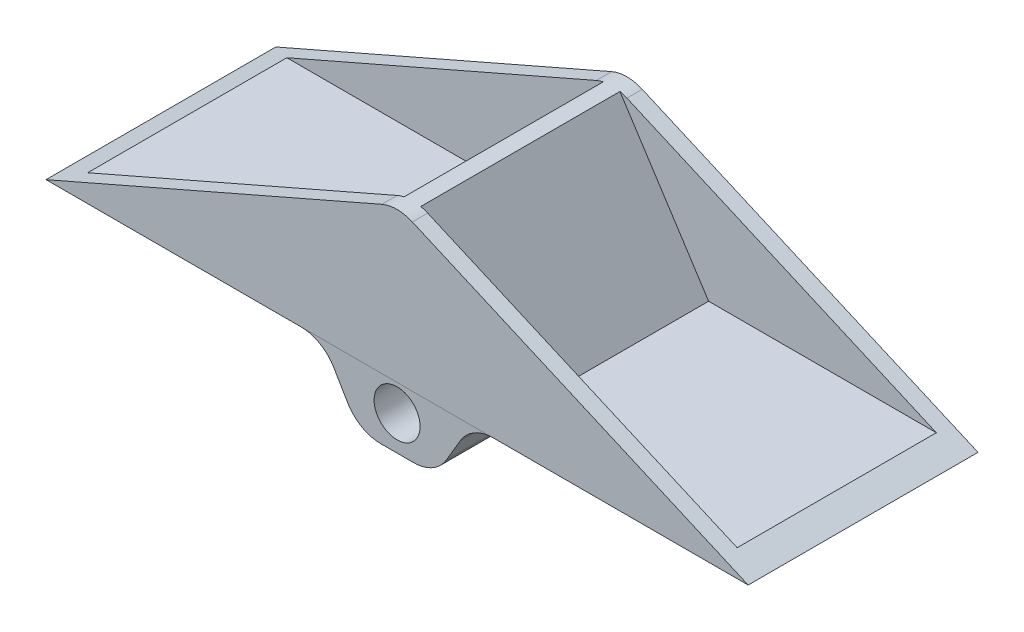
ISO-10303-21;
HEADER;
FILE_DESCRIPTION(('STEP AP214'),'2;1');
FILE_NAME('part.step','',(''),(''),'','','');
FILE_SCHEMA(('AUTOMOTIVE_DESIGN { 1 0 10303 214 1 1 1 1 }'));
ENDSEC;
DATA;
#1=APPLICATION_CONTEXT('core data for automotive mechanical design processes');
#2=APPLICATION_PROTOCOL_DEFINITION('international standard','automotive_design',2000,#1);
#3=PRODUCT_CONTEXT('',#1,'mechanical');
#4=PRODUCT('Part','Part','',(#3));
#5=PRODUCT_RELATED_PRODUCT_CATEGORY('part','',(#4));
#6=PRODUCT_DEFINITION_FORMATION('','',#4);
#7=PRODUCT_DEFINITION_CONTEXT('part definition',#1,'design');
#8=PRODUCT_DEFINITION('design','',#6,#7);
#9=PRODUCT_DEFINITION_SHAPE('','',#8);
#10=(LENGTH_UNIT() NAMED_UNIT(*) SI_UNIT(.MILLI.,.METRE.));
#11=(NAMED_UNIT(*) PLANE_ANGLE_UNIT() SI_UNIT($,.RADIAN.));
#12=(NAMED_UNIT(*) SI_UNIT($,.STERADIAN.) SOLID_ANGLE_UNIT());
#13=UNCERTAINTY_MEASURE_WITH_UNIT(LENGTH_MEASURE(1.E-05),#10,'distance_accuracy_value','');
#14=(GEOMETRIC_REPRESENTATION_CONTEXT(3) GLOBAL_UNCERTAINTY_ASSIGNED_CONTEXT((#13)) GLOBAL_UNIT_ASSIGNED_CONTEXT((#10,
#11,#12)) REPRESENTATION_CONTEXT('',''));
#15=CARTESIAN_POINT('',(0.,0.,0.));
#16=DIRECTION('',(0.,0.,1.));
#17=DIRECTION('',(1.,0.,0.));
#18=AXIS2_PLACEMENT_3D('',#15,#16,#17);
#19=CARTESIAN_POINT('',(-12.5662389811187,0.,30.));
#20=DIRECTION('',(0.000618349914558494,0.999999808821673,0.));
#21=DIRECTION('',(-0.999999808821673,0.000618349914558494,0.));
#22=AXIS2_PLACEMENT_3D('',#19,#20,#21);
#23=PLANE('',#22);
#24=DIRECTION('',(0.999999808821673,-0.000618349914558494,0.));
#25=VECTOR('',#24,1.);
#26=CARTESIAN_POINT('',(-4.80478462315431E-06,-0.00777033131477712,0.));
#27=LINE('',#26,#25);
#28=CARTESIAN_POINT('',(-12.5631472315459,-9.55891633208639E-07,0.));
#29=VERTEX_POINT('',#28);
#30=CARTESIAN_POINT('',(12.1753990297675,-0.0152989926749036,0.));
#31=VERTEX_POINT('',#30);
#32=EDGE_CURVE('E129',#29,#31,#27,.T.);
#33=ORIENTED_EDGE('',*,*,#32,.F.);
#34=DIRECTION('',(0.,0.,1.));
#35=VECTOR('',#34,1.);
#36=CARTESIAN_POINT('',(-12.5631472318414,-1.43383735873998E-06,30.));
#37=LINE('',#36,#35);
#38=CARTESIAN_POINT('',(-12.5631472315459,-9.55891633208639E-07,30.));
#39=VERTEX_POINT('',#38);
#40=EDGE_CURVE('E128',#39,#29,#37,.F.);
#41=ORIENTED_EDGE('',*,*,#40,.F.);
#42=DIRECTION('',(0.999999808821673,-0.000618349914558494,0.));
#43=VECTOR('',#42,1.);
#44=CARTESIAN_POINT('',(-4.80478462315431E-06,-0.00777033131477712,30.));
#45=LINE('',#44,#43);
#46=CARTESIAN_POINT('',(12.1753990297675,-0.0152989926749036,30.));
#47=VERTEX_POINT('',#46);
#48=EDGE_CURVE('E117',#39,#47,#45,.T.);
#49=ORIENTED_EDGE('',*,*,#48,.T.);
#50=DIRECTION('',(0.,0.,1.));
#51=VECTOR('',#50,1.);
#52=CARTESIAN_POINT('',(12.1753990297675,-0.0152989926749036,30.));
#53=LINE('',#52,#51);
#54=EDGE_CURVE('E127',#47,#31,#53,.F.);
#55=ORIENTED_EDGE('',*,*,#54,.T.);
#56=EDGE_LOOP('',(#33,#41,#49,#55));
#57=FACE_BOUND('',#56,.T.);
#58=ADVANCED_FACE('F45',(#57),#23,.T.);
#59=CARTESIAN_POINT('',(-2.14054862888333,-3.,30.));
#60=DIRECTION('',(0.,0.,1.));
#61=DIRECTION('',(1.,0.,0.));
#62=AXIS2_PLACEMENT_3D('',#59,#60,#61);
#63=CYLINDRICAL_SURFACE('',#62,5.);
#64=CARTESIAN_POINT('',(-2.14054862888333,-3.,30.));
#65=DIRECTION('',(0.,0.,-1.));
#66=DIRECTION('',(-1.,0.,0.));
#67=AXIS2_PLACEMENT_3D('',#64,#65,#66);
#68=CIRCLE('',#67,5.);
#69=CARTESIAN_POINT('',(-6.45000657940908,-5.5354629109199,30.));
#70=VERTEX_POINT('',#69);
#71=CARTESIAN_POINT('',(-2.14054862888333,-8.,30.));
#72=VERTEX_POINT('',#71);
#73=EDGE_CURVE('E143',#70,#72,#68,.F.);
#74=ORIENTED_EDGE('',*,*,#73,.F.);
#75=DIRECTION('',(0.,0.,-1.));
#76=VECTOR('',#75,1.);
#77=CARTESIAN_POINT('',(-6.45000657940908,-5.5354629109199,30.));
#78=LINE('',#77,#76);
#79=CARTESIAN_POINT('',(-6.45000657940908,-5.5354629109199,0.));
#80=VERTEX_POINT('',#79);
#81=EDGE_CURVE('E149',#80,#70,#78,.F.);
#82=ORIENTED_EDGE('',*,*,#81,.F.);
#83=CARTESIAN_POINT('',(-2.14054862888333,-3.,0.));
#84=DIRECTION('',(0.,0.,-1.));
#85=DIRECTION('',(-1.,0.,0.));
#86=AXIS2_PLACEMENT_3D('',#83,#84,#85);
#87=CIRCLE('',#86,5.);
#88=CARTESIAN_POINT('',(-2.14054862888333,-8.,0.));
#89=VERTEX_POINT('',#88);
#90=EDGE_CURVE('E153',#89,#80,#87,.T.);
#91=ORIENTED_EDGE('',*,*,#90,.F.);
#92=DIRECTION('',(0.,0.,-1.));
#93=VECTOR('',#92,1.);
#94=CARTESIAN_POINT('',(-2.14054862888333,-8.,0.));
#95=LINE('',#94,#93);
#96=EDGE_CURVE('E123',#72,#89,#95,.T.);
#97=ORIENTED_EDGE('',*,*,#96,.F.);
#98=EDGE_LOOP('',(#74,#82,#91,#97));
#99=FACE_BOUND('',#98,.T.);
#100=ADVANCED_FACE('F195',(#99),#63,.T.);
#101=CARTESIAN_POINT('',(0.,-8.,30.));
#102=DIRECTION('',(0.,1.,0.));
#103=DIRECTION('',(0.,0.,1.));
#104=AXIS2_PLACEMENT_3D('',#101,#102,#103);
#105=PLANE('',#104);
#106=DIRECTION('',(1.,0.,0.));
#107=VECTOR('',#106,1.);
#108=CARTESIAN_POINT('',(0.,-8.,30.));
#109=LINE('',#108,#107);
#110=CARTESIAN_POINT('',(2.14054862888333,-8.,30.));
#111=VERTEX_POINT('',#110);
#112=EDGE_CURVE('E170',#72,#111,#109,.T.);
#113=ORIENTED_EDGE('',*,*,#112,.F.);
#114=ORIENTED_EDGE('',*,*,#96,.T.);
#115=DIRECTION('',(1.,0.,0.));
#116=VECTOR('',#115,1.);
#117=CARTESIAN_POINT('',(0.,-8.,0.));
#118=LINE('',#117,#116);
#119=CARTESIAN_POINT('',(2.14054862888333,-8.,0.));
#120=VERTEX_POINT('',#119);
#121=EDGE_CURVE('E169',#89,#120,#118,.T.);
#122=ORIENTED_EDGE('',*,*,#121,.T.);
#123=DIRECTION('',(0.,0.,-1.));
#124=VECTOR('',#123,1.);
#125=CARTESIAN_POINT('',(2.14054862888333,-8.,30.));
#126=LINE('',#125,#124);
#127=EDGE_CURVE('E160',#120,#111,#126,.F.);
#128=ORIENTED_EDGE('',*,*,#127,.T.);
#129=EDGE_LOOP('',(#113,#114,#122,#128));
#130=FACE_BOUND('',#129,.T.);
#131=ADVANCED_FACE('F187',(#130),#105,.F.);
#132=CARTESIAN_POINT('',(2.14054862888333,-3.,30.));
#133=DIRECTION('',(0.,0.,-1.));
#134=DIRECTION('',(-1.,0.,0.));
#135=AXIS2_PLACEMENT_3D('',#132,#133,#134);
#136=CYLINDRICAL_SURFACE('',#135,5.);
#137=CARTESIAN_POINT('',(2.14054862888333,-3.,30.));
#138=DIRECTION('',(0.,0.,-1.));
#139=DIRECTION('',(-1.,0.,0.));
#140=AXIS2_PLACEMENT_3D('',#137,#138,#139);
#141=CIRCLE('',#140,5.);
#142=CARTESIAN_POINT('',(6.45000657940908,-5.5354629109199,30.));
#143=VERTEX_POINT('',#142);
#144=EDGE_CURVE('E70',#111,#143,#141,.F.);
#145=ORIENTED_EDGE('',*,*,#144,.F.);
#146=ORIENTED_EDGE('',*,*,#127,.F.);
#147=CARTESIAN_POINT('',(2.14054862888333,-3.,0.));
#148=DIRECTION('',(0.,0.,-1.));
#149=DIRECTION('',(-1.,0.,0.));
#150=AXIS2_PLACEMENT_3D('',#147,#148,#149);
#151=CIRCLE('',#150,5.);
#152=CARTESIAN_POINT('',(6.45000657940908,-5.5354629109199,0.));
#153=VERTEX_POINT('',#152);
#154=EDGE_CURVE('E62',#153,#120,#151,.T.);
#155=ORIENTED_EDGE('',*,*,#154,.F.);
#156=DIRECTION('',(0.,0.,-1.));
#157=VECTOR('',#156,1.);
#158=CARTESIAN_POINT('',(6.45000657940908,-5.5354629109199,30.));
#159=LINE('',#158,#157);
#160=EDGE_CURVE('E164',#143,#153,#159,.T.);
#161=ORIENTED_EDGE('',*,*,#160,.F.);
#162=EDGE_LOOP('',(#145,#146,#155,#161));
#163=FACE_BOUND('',#162,.T.);
#164=ADVANCED_FACE('F184',(#163),#136,.T.);
#165=CARTESIAN_POINT('',(0.,-3.5,30.));
#166=DIRECTION('',(0.,0.,-1.));
#167=DIRECTION('',(-1.,0.,0.));
#168=AXIS2_PLACEMENT_3D('',#165,#166,#167);
#169=CYLINDRICAL_SURFACE('',#168,3.);
#170=CARTESIAN_POINT('',(0.,-3.5,30.));
#171=DIRECTION('',(0.,0.,1.));
#172=DIRECTION('',(1.,0.,0.));
#173=AXIS2_PLACEMENT_3D('',#170,#171,#172);
#174=CIRCLE('',#173,3.);
#175=CARTESIAN_POINT('',(3.,-3.5,30.));
#176=VERTEX_POINT('',#175);
#177=EDGE_CURVE('E54',#176,#176,#174,.T.);
#178=ORIENTED_EDGE('',*,*,#177,.T.);
#179=EDGE_LOOP('',(#178));
#180=FACE_BOUND('',#179,.T.);
#181=CARTESIAN_POINT('',(0.,-3.5,0.));
#182=DIRECTION('',(0.,0.,1.));
#183=DIRECTION('',(1.,0.,0.));
#184=AXIS2_PLACEMENT_3D('',#181,#182,#183);
#185=CIRCLE('',#184,3.);
#186=CARTESIAN_POINT('',(3.,-3.5,0.));
#187=VERTEX_POINT('',#186);
#188=EDGE_CURVE('E12',#187,#187,#185,.T.);
#189=ORIENTED_EDGE('',*,*,#188,.F.);
#190=EDGE_LOOP('',(#189));
#191=FACE_BOUND('',#190,.T.);
#192=ADVANCED_FACE('F217',(#180,#191),#169,.F.);
#193=CARTESIAN_POINT('',(5.,-8.,30.));
#194=DIRECTION('',(-0.86189159010515,0.507092582183979,0.));
#195=DIRECTION('',(-0.507092582183979,-0.86189159010515,0.));
#196=AXIS2_PLACEMENT_3D('',#193,#194,#195);
#197=PLANE('',#196);
#198=DIRECTION('',(0.507092582183979,0.86189159010515,0.));
#199=VECTOR('',#198,1.);
#200=CARTESIAN_POINT('',(5.,-8.,0.));
#201=LINE('',#200,#199);
#202=CARTESIAN_POINT('',(8.25678103059292,-2.4645370890801,0.));
#203=VERTEX_POINT('',#202);
#204=EDGE_CURVE('E166',#153,#203,#201,.T.);
#205=ORIENTED_EDGE('',*,*,#204,.T.);
#206=DIRECTION('',(0.,0.,-1.));
#207=VECTOR('',#206,1.);
#208=CARTESIAN_POINT('',(8.25678103059292,-2.4645370890801,30.));
#209=LINE('',#208,#207);
#210=CARTESIAN_POINT('',(8.25678103059292,-2.4645370890801,30.));
#211=VERTEX_POINT('',#210);
#212=EDGE_CURVE('E157',#203,#211,#209,.F.);
#213=ORIENTED_EDGE('',*,*,#212,.T.);
#214=DIRECTION('',(0.507092582183979,0.86189159010515,0.));
#215=VECTOR('',#214,1.);
#216=CARTESIAN_POINT('',(5.,-8.,30.));
#217=LINE('',#216,#215);
#218=EDGE_CURVE('E119',#143,#211,#217,.T.);
#219=ORIENTED_EDGE('',*,*,#218,.F.);
#220=ORIENTED_EDGE('',*,*,#160,.T.);
#221=EDGE_LOOP('',(#205,#213,#219,#220));
#222=FACE_BOUND('',#221,.T.);
#223=ADVANCED_FACE('F183',(#222),#197,.F.);
#224=CARTESIAN_POINT('',(-5.,-8.,30.));
#225=DIRECTION('',(-0.86189159010515,-0.507092582183979,0.));
#226=DIRECTION('',(0.507092582183979,-0.86189159010515,0.));
#227=AXIS2_PLACEMENT_3D('',#224,#225,#226);
#228=PLANE('',#227);
#229=DIRECTION('',(-0.507092582183979,0.86189159010515,0.));
#230=VECTOR('',#229,1.);
#231=CARTESIAN_POINT('',(-5.,-8.,30.));
#232=LINE('',#231,#230);
#233=CARTESIAN_POINT('',(-8.25678103059292,-2.4645370890801,30.));
#234=VERTEX_POINT('',#233);
#235=EDGE_CURVE('E172',#70,#234,#232,.T.);
#236=ORIENTED_EDGE('',*,*,#235,.T.);
#237=DIRECTION('',(0.,0.,-1.));
#238=VECTOR('',#237,1.);
#239=CARTESIAN_POINT('',(-8.25678103059292,-2.4645370890801,0.));
#240=LINE('',#239,#238);
#241=CARTESIAN_POINT('',(-8.25678103059292,-2.4645370890801,0.));
#242=VERTEX_POINT('',#241);
#243=EDGE_CURVE('E139',#234,#242,#240,.T.);
#244=ORIENTED_EDGE('',*,*,#243,.T.);
#245=DIRECTION('',(-0.507092582183979,0.86189159010515,0.));
#246=VECTOR('',#245,1.);
#247=CARTESIAN_POINT('',(-5.,-8.,0.));
#248=LINE('',#247,#246);
#249=EDGE_CURVE('E175',#80,#242,#248,.T.);
#250=ORIENTED_EDGE('',*,*,#249,.F.);
#251=ORIENTED_EDGE('',*,*,#81,.T.);
#252=EDGE_LOOP('',(#236,#244,#250,#251));
#253=FACE_BOUND('',#252,.T.);
#254=ADVANCED_FACE('F192',(#253),#228,.T.);
#255=CARTESIAN_POINT('',(0.,0.,0.));
#256=DIRECTION('',(0.,0.,-1.));
#257=DIRECTION('',(-1.,0.,0.));
#258=AXIS2_PLACEMENT_3D('',#255,#256,#257);
#259=PLANE('',#258);
#260=ORIENTED_EDGE('',*,*,#188,.T.);
#261=EDGE_LOOP('',(#260));
#262=FACE_BOUND('',#261,.T.);
#263=CARTESIAN_POINT('',(-12.5662389811187,-5.,0.));
#264=DIRECTION('',(0.,0.,-1.));
#265=DIRECTION('',(-1.,0.,0.));
#266=AXIS2_PLACEMENT_3D('',#263,#264,#265);
#267=CIRCLE('',#266,5.);
#268=EDGE_CURVE('E137',#242,#29,#267,.F.);
#269=ORIENTED_EDGE('',*,*,#268,.T.);
#270=ORIENTED_EDGE('',*,*,#32,.T.);
#271=CARTESIAN_POINT('',(12.5662389811187,-5.,0.));
#272=DIRECTION('',(0.,0.,-1.));
#273=DIRECTION('',(-1.,0.,0.));
#274=AXIS2_PLACEMENT_3D('',#271,#272,#273);
#275=CIRCLE('',#274,5.);
#276=EDGE_CURVE('E49',#31,#203,#275,.F.);
#277=ORIENTED_EDGE('',*,*,#276,.T.);
#278=ORIENTED_EDGE('',*,*,#204,.F.);
#279=ORIENTED_EDGE('',*,*,#154,.T.);
#280=ORIENTED_EDGE('',*,*,#121,.F.);
#281=ORIENTED_EDGE('',*,*,#90,.T.);
#282=ORIENTED_EDGE('',*,*,#249,.T.);
#283=EDGE_LOOP('',(#269,#270,#277,#278,#279,#280,#281,#282));
#284=FACE_BOUND('',#283,.T.);
#285=ADVANCED_FACE('F180',(#262,#284),#259,.T.);
#286=CARTESIAN_POINT('',(0.,0.,30.));
#287=DIRECTION('',(0.,0.,-1.));
#288=DIRECTION('',(-1.,0.,0.));
#289=AXIS2_PLACEMENT_3D('',#286,#287,#288);
#290=PLANE('',#289);
#291=ORIENTED_EDGE('',*,*,#177,.F.);
#292=EDGE_LOOP('',(#291));
#293=FACE_BOUND('',#292,.T.);
#294=ORIENTED_EDGE('',*,*,#48,.F.);
#295=CARTESIAN_POINT('',(-12.5662389811187,-5.,30.));
#296=DIRECTION('',(0.,0.,-1.));
#297=DIRECTION('',(-1.,0.,0.));
#298=AXIS2_PLACEMENT_3D('',#295,#296,#297);
#299=CIRCLE('',#298,5.);
#300=EDGE_CURVE('E135',#39,#234,#299,.T.);
#301=ORIENTED_EDGE('',*,*,#300,.T.);
#302=ORIENTED_EDGE('',*,*,#235,.F.);
#303=ORIENTED_EDGE('',*,*,#73,.T.);
#304=ORIENTED_EDGE('',*,*,#112,.T.);
#305=ORIENTED_EDGE('',*,*,#144,.T.);
#306=ORIENTED_EDGE('',*,*,#218,.T.);
#307=CARTESIAN_POINT('',(12.5662389811187,-5.,30.));
#308=DIRECTION('',(0.,0.,-1.));
#309=DIRECTION('',(-1.,0.,0.));
#310=AXIS2_PLACEMENT_3D('',#307,#308,#309);
#311=CIRCLE('',#310,5.);
#312=EDGE_CURVE('E114',#211,#47,#311,.T.);
#313=ORIENTED_EDGE('',*,*,#312,.T.);
#314=EDGE_LOOP('',(#294,#301,#302,#303,#304,#305,#306,#313));
#315=FACE_BOUND('',#314,.T.);
#316=ADVANCED_FACE('F116',(#293,#315),#290,.F.);
#317=CARTESIAN_POINT('',(-12.5662389811187,-5.,30.));
#318=DIRECTION('',(0.,0.,1.));
#319=DIRECTION('',(1.,0.,0.));
#320=AXIS2_PLACEMENT_3D('',#317,#318,#319);
#321=CYLINDRICAL_SURFACE('',#320,5.);
#322=ORIENTED_EDGE('',*,*,#300,.F.);
#323=ORIENTED_EDGE('',*,*,#40,.T.);
#324=ORIENTED_EDGE('',*,*,#268,.F.);
#325=ORIENTED_EDGE('',*,*,#243,.F.);
#326=EDGE_LOOP('',(#322,#323,#324,#325));
#327=FACE_BOUND('',#326,.T.);
#328=ADVANCED_FACE('F197',(#327),#321,.F.);
#329=CARTESIAN_POINT('',(12.5662389811187,-5.,30.));
#330=DIRECTION('',(0.,0.,1.));
#331=DIRECTION('',(1.,0.,0.));
#332=AXIS2_PLACEMENT_3D('',#329,#330,#331);
#333=CYLINDRICAL_SURFACE('',#332,5.);
#334=ORIENTED_EDGE('',*,*,#54,.F.);
#335=ORIENTED_EDGE('',*,*,#312,.F.);
#336=ORIENTED_EDGE('',*,*,#212,.F.);
#337=ORIENTED_EDGE('',*,*,#276,.F.);
#338=EDGE_LOOP('',(#334,#335,#336,#337));
#339=FACE_BOUND('',#338,.T.);
#340=ADVANCED_FACE('F47',(#339),#333,.F.);
#341=CLOSED_SHELL('',(#58,#100,#131,#164,#192,#223,#254,#285,#316,#328,#340));
#342=MANIFOLD_SOLID_BREP('B2',#341);
#343=CARTESIAN_POINT('',(-12.5662389811187,0.,30.));
#344=DIRECTION('',(0.000618349914558494,0.999999808821673,0.));
#345=DIRECTION('',(-0.999999808821673,0.000618349914558494,0.));
#346=AXIS2_PLACEMENT_3D('',#343,#344,#345);
#347=PLANE('',#346);
#348=DIRECTION('',(0.999999808821673,-0.000618349914558494,0.));
#349=VECTOR('',#348,1.);
#350=CARTESIAN_POINT('',(-4.80478462315431E-06,-0.00777033131477712,0.));
#351=LINE('',#350,#349);
#352=CARTESIAN_POINT('',(-12.5631472315459,-9.55891633208639E-07,0.));
#353=VERTEX_POINT('',#352);
#354=CARTESIAN_POINT('',(12.1753990297675,-0.0152989926749036,0.));
#355=VERTEX_POINT('',#354);
#356=EDGE_CURVE('E314',#353,#355,#351,.T.);
#357=ORIENTED_EDGE('',*,*,#356,.T.);
#358=DIRECTION('',(0.,0.,1.));
#359=VECTOR('',#358,1.);
#360=CARTESIAN_POINT('',(12.1753990297675,-0.0152989926749036,30.));
#361=LINE('',#360,#359);
#362=CARTESIAN_POINT('',(12.1753990297675,-0.0152989926749036,30.));
#363=VERTEX_POINT('',#362);
#364=EDGE_CURVE('E542',#363,#355,#361,.F.);
#365=ORIENTED_EDGE('',*,*,#364,.F.);
#366=DIRECTION('',(0.999999808821673,-0.000618349914558494,0.));
#367=VECTOR('',#366,1.);
#368=CARTESIAN_POINT('',(-4.80478462315431E-06,-0.00777033131477712,30.));
#369=LINE('',#368,#367);
#370=CARTESIAN_POINT('',(-12.5631472315459,-9.55891633208639E-07,30.));
#371=VERTEX_POINT('',#370);
#372=EDGE_CURVE('E545',#371,#363,#369,.T.);
#373=ORIENTED_EDGE('',*,*,#372,.F.);
#374=DIRECTION('',(0.,0.,1.));
#375=VECTOR('',#374,1.);
#376=CARTESIAN_POINT('',(-12.5631472318414,-1.43383735873998E-06,30.));
#377=LINE('',#376,#375);
#378=EDGE_CURVE('E43',#371,#353,#377,.F.);
#379=ORIENTED_EDGE('',*,*,#378,.T.);
#380=EDGE_LOOP('',(#357,#365,#373,#379));
#381=FACE_BOUND('',#380,.T.);
#382=ADVANCED_FACE('F311',(#381),#347,.F.);
#383=CARTESIAN_POINT('',(-12.5662389811187,-5.,30.));
#384=DIRECTION('',(0.,0.,1.));
#385=DIRECTION('',(1.,0.,0.));
#386=AXIS2_PLACEMENT_3D('',#383,#384,#385);
#387=CYLINDRICAL_SURFACE('',#386,5.);
#388=ORIENTED_EDGE('',*,*,#378,.F.);
#389=CARTESIAN_POINT('',(-12.5662389811187,-5.,30.));
#390=DIRECTION('',(0.,0.,-1.));
#391=DIRECTION('',(-1.,0.,0.));
#392=AXIS2_PLACEMENT_3D('',#389,#390,#391);
#393=CIRCLE('',#392,5.);
#394=CARTESIAN_POINT('',(-12.5662389811187,0.,30.));
#395=VERTEX_POINT('',#394);
#396=EDGE_CURVE('E515',#395,#371,#393,.T.);
#397=ORIENTED_EDGE('',*,*,#396,.F.);
#398=DIRECTION('',(0.,0.,-1.));
#399=VECTOR('',#398,1.);
#400=CARTESIAN_POINT('',(-12.5662389811187,0.,30.));
#401=LINE('',#400,#399);
#402=CARTESIAN_POINT('',(-12.5662389811187,0.,0.));
#403=VERTEX_POINT('',#402);
#404=EDGE_CURVE('E510',#403,#395,#401,.F.);
#405=ORIENTED_EDGE('',*,*,#404,.F.);
#406=CARTESIAN_POINT('',(-12.5662389811187,-5.,0.));
#407=DIRECTION('',(0.,0.,-1.));
#408=DIRECTION('',(-1.,0.,0.));
#409=AXIS2_PLACEMENT_3D('',#406,#407,#408);
#410=CIRCLE('',#409,5.);
#411=EDGE_CURVE('E513',#353,#403,#410,.F.);
#412=ORIENTED_EDGE('',*,*,#411,.F.);
#413=EDGE_LOOP('',(#388,#397,#405,#412));
#414=FACE_BOUND('',#413,.T.);
#415=ADVANCED_FACE('F586',(#414),#387,.F.);
#416=CARTESIAN_POINT('',(-45.8257569495584,0.,30.));
#417=DIRECTION('',(-0.4,0.916515138991168,0.));
#418=DIRECTION('',(-0.916515138991168,-0.4,0.));
#419=AXIS2_PLACEMENT_3D('',#416,#417,#418);
#420=PLANE('',#419);
#421=DIRECTION('',(0.916515138991168,0.4,0.));
#422=VECTOR('',#421,1.);
#423=CARTESIAN_POINT('',(-45.8257569495584,0.,30.));
#424=LINE('',#423,#422);
#425=CARTESIAN_POINT('',(-45.8257569495584,0.,30.));
#426=VERTEX_POINT('',#425);
#427=CARTESIAN_POINT('',(-2.00000000000002,19.127128439056,30.));
#428=VERTEX_POINT('',#427);
#429=EDGE_CURVE('E458',#426,#428,#424,.T.);
#430=ORIENTED_EDGE('',*,*,#429,.T.);
#431=DIRECTION('',(0.,0.,-1.));
#432=VECTOR('',#431,1.);
#433=CARTESIAN_POINT('',(-2.00000000000001,19.127128439056,0.));
#434=LINE('',#433,#432);
#435=CARTESIAN_POINT('',(-2.,19.127128439056,28.));
#436=VERTEX_POINT('',#435);
#437=EDGE_CURVE('E521',#428,#436,#434,.T.);
#438=ORIENTED_EDGE('',*,*,#437,.T.);
#439=DIRECTION('',(0.916515138991168,0.4,0.));
#440=VECTOR('',#439,1.);
#441=CARTESIAN_POINT('',(-42.3888251783415,1.5,28.));
#442=LINE('',#441,#440);
#443=CARTESIAN_POINT('',(-42.3888251783415,1.5,28.));
#444=VERTEX_POINT('',#443);
#445=EDGE_CURVE('E432',#444,#436,#442,.T.);
#446=ORIENTED_EDGE('',*,*,#445,.F.);
#447=DIRECTION('',(0.,0.,-1.));
#448=VECTOR('',#447,1.);
#449=CARTESIAN_POINT('',(-42.3888251783415,1.5,28.));
#450=LINE('',#449,#448);
#451=CARTESIAN_POINT('',(-42.3888251783415,1.5,2.));
#452=VERTEX_POINT('',#451);
#453=EDGE_CURVE('E442',#444,#452,#450,.T.);
#454=ORIENTED_EDGE('',*,*,#453,.T.);
#455=DIRECTION('',(0.916515138991168,0.4,0.));
#456=VECTOR('',#455,1.);
#457=CARTESIAN_POINT('',(-42.3888251783415,1.5,2.));
#458=LINE('',#457,#456);
#459=CARTESIAN_POINT('',(-2.,19.127128439056,2.));
#460=VERTEX_POINT('',#459);
#461=EDGE_CURVE('E446',#452,#460,#458,.T.);
#462=ORIENTED_EDGE('',*,*,#461,.T.);
#463=DIRECTION('',(0.,0.,-1.));
#464=VECTOR('',#463,1.);
#465=CARTESIAN_POINT('',(-2.00000000000001,19.127128439056,0.));
#466=LINE('',#465,#464);
#467=CARTESIAN_POINT('',(-2.00000000000002,19.127128439056,0.));
#468=VERTEX_POINT('',#467);
#469=EDGE_CURVE('E519',#460,#468,#466,.T.);
#470=ORIENTED_EDGE('',*,*,#469,.T.);
#471=DIRECTION('',(0.916515138991168,0.4,0.));
#472=VECTOR('',#471,1.);
#473=CARTESIAN_POINT('',(-45.8257569495584,0.,0.));
#474=LINE('',#473,#472);
#475=CARTESIAN_POINT('',(-45.8257569495584,0.,0.));
#476=VERTEX_POINT('',#475);
#477=EDGE_CURVE('E459',#476,#468,#474,.T.);
#478=ORIENTED_EDGE('',*,*,#477,.F.);
#479=DIRECTION('',(0.,0.,-1.));
#480=VECTOR('',#479,1.);
#481=CARTESIAN_POINT('',(-45.8257569495584,0.,30.));
#482=LINE('',#481,#480);
#483=EDGE_CURVE('E462',#426,#476,#482,.T.);
#484=ORIENTED_EDGE('',*,*,#483,.F.);
#485=EDGE_LOOP('',(#430,#438,#446,#454,#462,#470,#478,#484));
#486=FACE_BOUND('',#485,.T.);
#487=ADVANCED_FACE('F580',(#486),#420,.T.);
#488=CARTESIAN_POINT('',(45.8257569495584,0.,30.));
#489=DIRECTION('',(-0.4,-0.916515138991168,0.));
#490=DIRECTION('',(0.916515138991168,-0.4,0.));
#491=AXIS2_PLACEMENT_3D('',#488,#489,#490);
#492=PLANE('',#491);
#493=DIRECTION('',(-0.916515138991168,0.4,0.));
#494=VECTOR('',#493,1.);
#495=CARTESIAN_POINT('',(45.8257569495584,0.,0.));
#496=LINE('',#495,#494);
#497=CARTESIAN_POINT('',(45.8257569495584,0.,0.));
#498=VERTEX_POINT('',#497);
#499=CARTESIAN_POINT('',(2.,19.127128439056,0.));
#500=VERTEX_POINT('',#499);
#501=EDGE_CURVE('E493',#498,#500,#496,.T.);
#502=ORIENTED_EDGE('',*,*,#501,.T.);
#503=DIRECTION('',(0.,0.,-1.));
#504=VECTOR('',#503,1.);
#505=CARTESIAN_POINT('',(2.,19.127128439056,30.));
#506=LINE('',#505,#504);
#507=CARTESIAN_POINT('',(1.99999999999999,19.127128439056,2.));
#508=VERTEX_POINT('',#507);
#509=EDGE_CURVE('E533',#500,#508,#506,.F.);
#510=ORIENTED_EDGE('',*,*,#509,.T.);
#511=DIRECTION('',(-0.916515138991168,0.4,0.));
#512=VECTOR('',#511,1.);
#513=CARTESIAN_POINT('',(42.3888251783415,1.5,2.));
#514=LINE('',#513,#512);
#515=CARTESIAN_POINT('',(42.3888251783415,1.5,2.));
#516=VERTEX_POINT('',#515);
#517=EDGE_CURVE('E480',#516,#508,#514,.T.);
#518=ORIENTED_EDGE('',*,*,#517,.F.);
#519=DIRECTION('',(0.,0.,-1.));
#520=VECTOR('',#519,1.);
#521=CARTESIAN_POINT('',(42.3888251783415,1.5,28.));
#522=LINE('',#521,#520);
#523=CARTESIAN_POINT('',(42.3888251783415,1.5,28.));
#524=VERTEX_POINT('',#523);
#525=EDGE_CURVE('E486',#524,#516,#522,.T.);
#526=ORIENTED_EDGE('',*,*,#525,.F.);
#527=DIRECTION('',(-0.916515138991168,0.4,0.));
#528=VECTOR('',#527,1.);
#529=CARTESIAN_POINT('',(42.3888251783415,1.5,28.));
#530=LINE('',#529,#528);
#531=CARTESIAN_POINT('',(1.99999999999999,19.127128439056,28.));
#532=VERTEX_POINT('',#531);
#533=EDGE_CURVE('E472',#524,#532,#530,.T.);
#534=ORIENTED_EDGE('',*,*,#533,.T.);
#535=DIRECTION('',(0.,0.,-1.));
#536=VECTOR('',#535,1.);
#537=CARTESIAN_POINT('',(2.,19.127128439056,30.));
#538=LINE('',#537,#536);
#539=CARTESIAN_POINT('',(2.,19.127128439056,30.));
#540=VERTEX_POINT('',#539);
#541=EDGE_CURVE('E531',#532,#540,#538,.F.);
#542=ORIENTED_EDGE('',*,*,#541,.T.);
#543=DIRECTION('',(-0.916515138991168,0.4,0.));
#544=VECTOR('',#543,1.);
#545=CARTESIAN_POINT('',(45.8257569495584,0.,30.));
#546=LINE('',#545,#544);
#547=CARTESIAN_POINT('',(45.8257569495584,0.,30.));
#548=VERTEX_POINT('',#547);
#549=EDGE_CURVE('E492',#548,#540,#546,.T.);
#550=ORIENTED_EDGE('',*,*,#549,.F.);
#551=DIRECTION('',(0.,0.,-1.));
#552=VECTOR('',#551,1.);
#553=CARTESIAN_POINT('',(45.8257569495584,0.,30.));
#554=LINE('',#553,#552);
#555=EDGE_CURVE('E496',#548,#498,#554,.T.);
#556=ORIENTED_EDGE('',*,*,#555,.T.);
#557=EDGE_LOOP('',(#502,#510,#518,#526,#534,#542,#550,#556));
#558=FACE_BOUND('',#557,.T.);
#559=ADVANCED_FACE('F567',(#558),#492,.F.);
#560=CARTESIAN_POINT('',(9.70678761000199,0.,30.));
#561=DIRECTION('',(0.,1.,0.));
#562=DIRECTION('',(0.,0.,1.));
#563=AXIS2_PLACEMENT_3D('',#560,#561,#562);
#564=PLANE('',#563);
#565=DIRECTION('',(1.,0.,0.));
#566=VECTOR('',#565,1.);
#567=CARTESIAN_POINT('',(9.70678761000199,0.,30.));
#568=LINE('',#567,#566);
#569=CARTESIAN_POINT('',(12.5662389811187,0.,30.));
#570=VERTEX_POINT('',#569);
#571=EDGE_CURVE('E490',#570,#548,#568,.T.);
#572=ORIENTED_EDGE('',*,*,#571,.F.);
#573=DIRECTION('',(0.,0.,-1.));
#574=VECTOR('',#573,1.);
#575=CARTESIAN_POINT('',(12.5662389811187,0.,0.));
#576=LINE('',#575,#574);
#577=CARTESIAN_POINT('',(12.5662389811187,0.,0.));
#578=VERTEX_POINT('',#577);
#579=EDGE_CURVE('E502',#570,#578,#576,.T.);
#580=ORIENTED_EDGE('',*,*,#579,.T.);
#581=DIRECTION('',(1.,0.,0.));
#582=VECTOR('',#581,1.);
#583=CARTESIAN_POINT('',(9.70678761000199,0.,0.));
#584=LINE('',#583,#582);
#585=EDGE_CURVE('E489',#578,#498,#584,.T.);
#586=ORIENTED_EDGE('',*,*,#585,.T.);
#587=ORIENTED_EDGE('',*,*,#555,.F.);
#588=EDGE_LOOP('',(#572,#580,#586,#587));
#589=FACE_BOUND('',#588,.T.);
#590=ADVANCED_FACE('F561',(#589),#564,.F.);
#591=CARTESIAN_POINT('',(0.,0.,30.));
#592=DIRECTION('',(0.,0.,-1.));
#593=DIRECTION('',(-1.,0.,0.));
#594=AXIS2_PLACEMENT_3D('',#591,#592,#593);
#595=PLANE('',#594);
#596=ORIENTED_EDGE('',*,*,#396,.T.);
#597=ORIENTED_EDGE('',*,*,#372,.T.);
#598=CARTESIAN_POINT('',(12.5662389811187,-5.,30.));
#599=DIRECTION('',(0.,0.,-1.));
#600=DIRECTION('',(-1.,0.,0.));
#601=AXIS2_PLACEMENT_3D('',#598,#599,#600);
#602=CIRCLE('',#601,5.);
#603=EDGE_CURVE('E508',#363,#570,#602,.T.);
#604=ORIENTED_EDGE('',*,*,#603,.T.);
#605=ORIENTED_EDGE('',*,*,#571,.T.);
#606=ORIENTED_EDGE('',*,*,#549,.T.);
#607=CARTESIAN_POINT('',(0.,14.5445527441002,30.));
#608=DIRECTION('',(0.,0.,-1.));
#609=DIRECTION('',(-1.,0.,0.));
#610=AXIS2_PLACEMENT_3D('',#607,#608,#609);
#611=CIRCLE('',#610,5.);
#612=EDGE_CURVE('E541',#540,#428,#611,.F.);
#613=ORIENTED_EDGE('',*,*,#612,.T.);
#614=ORIENTED_EDGE('',*,*,#429,.F.);
#615=DIRECTION('',(-1.,0.,0.));
#616=VECTOR('',#615,1.);
#617=CARTESIAN_POINT('',(-9.70678761000199,0.,30.));
#618=LINE('',#617,#616);
#619=EDGE_CURVE('E456',#395,#426,#618,.T.);
#620=ORIENTED_EDGE('',*,*,#619,.F.);
#621=EDGE_LOOP('',(#596,#597,#604,#605,#606,#613,#614,#620));
#622=FACE_BOUND('',#621,.T.);
#623=ADVANCED_FACE('F564',(#622),#595,.F.);
#624=CARTESIAN_POINT('',(0.,0.,0.));
#625=DIRECTION('',(0.,0.,-1.));
#626=DIRECTION('',(-1.,0.,0.));
#627=AXIS2_PLACEMENT_3D('',#624,#625,#626);
#628=PLANE('',#627);
#629=ORIENTED_EDGE('',*,*,#356,.F.);
#630=ORIENTED_EDGE('',*,*,#411,.T.);
#631=DIRECTION('',(-1.,0.,0.));
#632=VECTOR('',#631,1.);
#633=CARTESIAN_POINT('',(-9.70678761000199,0.,0.));
#634=LINE('',#633,#632);
#635=EDGE_CURVE('E441',#403,#476,#634,.T.);
#636=ORIENTED_EDGE('',*,*,#635,.T.);
#637=ORIENTED_EDGE('',*,*,#477,.T.);
#638=CARTESIAN_POINT('',(0.,14.5445527441002,0.));
#639=DIRECTION('',(0.,0.,-1.));
#640=DIRECTION('',(-1.,0.,0.));
#641=AXIS2_PLACEMENT_3D('',#638,#639,#640);
#642=CIRCLE('',#641,5.);
#643=EDGE_CURVE('E529',#468,#500,#642,.T.);
#644=ORIENTED_EDGE('',*,*,#643,.T.);
#645=ORIENTED_EDGE('',*,*,#501,.F.);
#646=ORIENTED_EDGE('',*,*,#585,.F.);
#647=CARTESIAN_POINT('',(12.5662389811187,-5.,0.));
#648=DIRECTION('',(0.,0.,-1.));
#649=DIRECTION('',(-1.,0.,0.));
#650=AXIS2_PLACEMENT_3D('',#647,#648,#649);
#651=CIRCLE('',#650,5.);
#652=EDGE_CURVE('E505',#578,#355,#651,.F.);
#653=ORIENTED_EDGE('',*,*,#652,.T.);
#654=EDGE_LOOP('',(#629,#630,#636,#637,#644,#645,#646,#653));
#655=FACE_BOUND('',#654,.T.);
#656=ADVANCED_FACE('F554',(#655),#628,.T.);
#657=CARTESIAN_POINT('',(12.6638456497563,1.5,28.));
#658=DIRECTION('',(0.,1.,0.));
#659=DIRECTION('',(0.,0.,1.));
#660=AXIS2_PLACEMENT_3D('',#657,#658,#659);
#661=PLANE('',#660);
#662=DIRECTION('',(1.,0.,0.));
#663=VECTOR('',#662,1.);
#664=CARTESIAN_POINT('',(12.6638456497563,1.5,2.));
#665=LINE('',#664,#663);
#666=CARTESIAN_POINT('',(12.6638456497563,1.5,2.));
#667=VERTEX_POINT('',#666);
#668=EDGE_CURVE('E468',#667,#516,#665,.T.);
#669=ORIENTED_EDGE('',*,*,#668,.F.);
#670=DIRECTION('',(0.,0.,-1.));
#671=VECTOR('',#670,1.);
#672=CARTESIAN_POINT('',(12.6638456497563,1.5,28.));
#673=LINE('',#672,#671);
#674=CARTESIAN_POINT('',(12.6638456497563,1.5,28.));
#675=VERTEX_POINT('',#674);
#676=EDGE_CURVE('E478',#675,#667,#673,.T.);
#677=ORIENTED_EDGE('',*,*,#676,.F.);
#678=DIRECTION('',(1.,0.,0.));
#679=VECTOR('',#678,1.);
#680=CARTESIAN_POINT('',(12.6638456497563,1.5,28.));
#681=LINE('',#680,#679);
#682=EDGE_CURVE('E469',#675,#524,#681,.T.);
#683=ORIENTED_EDGE('',*,*,#682,.T.);
#684=ORIENTED_EDGE('',*,*,#525,.T.);
#685=EDGE_LOOP('',(#669,#677,#683,#684));
#686=FACE_BOUND('',#685,.T.);
#687=ADVANCED_FACE('F598',(#686),#661,.T.);
#688=CARTESIAN_POINT('',(1.,19.563564219528,28.));
#689=DIRECTION('',(0.84008613666888,0.542453023751141,0.));
#690=DIRECTION('',(-0.542453023751141,0.84008613666888,0.));
#691=AXIS2_PLACEMENT_3D('',#688,#689,#690);
#692=PLANE('',#691);
#693=DIRECTION('',(0.542453023751141,-0.84008613666888,0.));
#694=VECTOR('',#693,1.);
#695=CARTESIAN_POINT('',(1.,19.563564219528,2.));
#696=LINE('',#695,#694);
#697=CARTESIAN_POINT('',(1.08991430857097,19.4243157301449,2.));
#698=VERTEX_POINT('',#697);
#699=EDGE_CURVE('E473',#698,#667,#696,.T.);
#700=ORIENTED_EDGE('',*,*,#699,.F.);
#701=DIRECTION('',(0.,0.,1.));
#702=VECTOR('',#701,1.);
#703=CARTESIAN_POINT('',(1.08991430857097,19.4243157301449,2.));
#704=LINE('',#703,#702);
#705=CARTESIAN_POINT('',(1.08991430857097,19.4243157301449,28.));
#706=VERTEX_POINT('',#705);
#707=EDGE_CURVE('E537',#698,#706,#704,.T.);
#708=ORIENTED_EDGE('',*,*,#707,.T.);
#709=DIRECTION('',(0.542453023751141,-0.84008613666888,0.));
#710=VECTOR('',#709,1.);
#711=CARTESIAN_POINT('',(1.,19.563564219528,28.));
#712=LINE('',#711,#710);
#713=EDGE_CURVE('E476',#706,#675,#712,.T.);
#714=ORIENTED_EDGE('',*,*,#713,.T.);
#715=ORIENTED_EDGE('',*,*,#676,.T.);
#716=EDGE_LOOP('',(#700,#708,#714,#715));
#717=FACE_BOUND('',#716,.T.);
#718=ADVANCED_FACE('F604',(#717),#692,.T.);
#719=CARTESIAN_POINT('',(0.,0.,28.));
#720=DIRECTION('',(0.,0.,-1.));
#721=DIRECTION('',(-1.,0.,0.));
#722=AXIS2_PLACEMENT_3D('',#719,#720,#721);
#723=PLANE('',#722);
#724=ORIENTED_EDGE('',*,*,#713,.F.);
#725=CARTESIAN_POINT('',(0.,14.5445527441002,28.));
#726=DIRECTION('',(0.,0.,-1.));
#727=DIRECTION('',(-1.,0.,0.));
#728=AXIS2_PLACEMENT_3D('',#725,#726,#727);
#729=CIRCLE('',#728,5.);
#730=EDGE_CURVE('E539',#706,#532,#729,.T.);
#731=ORIENTED_EDGE('',*,*,#730,.T.);
#732=ORIENTED_EDGE('',*,*,#533,.F.);
#733=ORIENTED_EDGE('',*,*,#682,.F.);
#734=EDGE_LOOP('',(#724,#731,#732,#733));
#735=FACE_BOUND('',#734,.T.);
#736=ADVANCED_FACE('F602',(#735),#723,.T.);
#737=CARTESIAN_POINT('',(0.,0.,2.));
#738=DIRECTION('',(0.,0.,-1.));
#739=DIRECTION('',(-1.,0.,0.));
#740=AXIS2_PLACEMENT_3D('',#737,#738,#739);
#741=PLANE('',#740);
#742=ORIENTED_EDGE('',*,*,#517,.T.);
#743=CARTESIAN_POINT('',(0.,14.5445527441002,2.));
#744=DIRECTION('',(0.,0.,-1.));
#745=DIRECTION('',(-1.,0.,0.));
#746=AXIS2_PLACEMENT_3D('',#743,#744,#745);
#747=CIRCLE('',#746,5.);
#748=EDGE_CURVE('E535',#508,#698,#747,.F.);
#749=ORIENTED_EDGE('',*,*,#748,.T.);
#750=ORIENTED_EDGE('',*,*,#699,.T.);
#751=ORIENTED_EDGE('',*,*,#668,.T.);
#752=EDGE_LOOP('',(#742,#749,#750,#751));
#753=FACE_BOUND('',#752,.T.);
#754=ADVANCED_FACE('F593',(#753),#741,.F.);
#755=CARTESIAN_POINT('',(12.5662389811187,-5.,30.));
#756=DIRECTION('',(0.,0.,1.));
#757=DIRECTION('',(1.,0.,0.));
#758=AXIS2_PLACEMENT_3D('',#755,#756,#757);
#759=CYLINDRICAL_SURFACE('',#758,5.);
#760=ORIENTED_EDGE('',*,*,#603,.F.);
#761=ORIENTED_EDGE('',*,*,#364,.T.);
#762=ORIENTED_EDGE('',*,*,#652,.F.);
#763=ORIENTED_EDGE('',*,*,#579,.F.);
#764=EDGE_LOOP('',(#760,#761,#762,#763));
#765=FACE_BOUND('',#764,.T.);
#766=ADVANCED_FACE('F558',(#765),#759,.F.);
#767=CARTESIAN_POINT('',(-9.70678761000199,0.,30.));
#768=DIRECTION('',(0.,-1.,0.));
#769=DIRECTION('',(0.,0.,-1.));
#770=AXIS2_PLACEMENT_3D('',#767,#768,#769);
#771=PLANE('',#770);
#772=ORIENTED_EDGE('',*,*,#635,.F.);
#773=ORIENTED_EDGE('',*,*,#404,.T.);
#774=ORIENTED_EDGE('',*,*,#619,.T.);
#775=ORIENTED_EDGE('',*,*,#483,.T.);
#776=EDGE_LOOP('',(#772,#773,#774,#775));
#777=FACE_BOUND('',#776,.T.);
#778=ADVANCED_FACE('F584',(#777),#771,.T.);
#779=CARTESIAN_POINT('',(-12.6638456497563,1.5,28.));
#780=DIRECTION('',(0.,-1.,0.));
#781=DIRECTION('',(0.,0.,-1.));
#782=AXIS2_PLACEMENT_3D('',#779,#780,#781);
#783=PLANE('',#782);
#784=DIRECTION('',(-1.,0.,0.));
#785=VECTOR('',#784,1.);
#786=CARTESIAN_POINT('',(-12.6638456497563,1.5,2.));
#787=LINE('',#786,#785);
#788=CARTESIAN_POINT('',(-12.6638456497563,1.5,2.));
#789=VERTEX_POINT('',#788);
#790=EDGE_CURVE('E452',#789,#452,#787,.T.);
#791=ORIENTED_EDGE('',*,*,#790,.T.);
#792=ORIENTED_EDGE('',*,*,#453,.F.);
#793=DIRECTION('',(-1.,0.,0.));
#794=VECTOR('',#793,1.);
#795=CARTESIAN_POINT('',(-12.6638456497563,1.5,28.));
#796=LINE('',#795,#794);
#797=CARTESIAN_POINT('',(-12.6638456497563,1.5,28.));
#798=VERTEX_POINT('',#797);
#799=EDGE_CURVE('E427',#798,#444,#796,.T.);
#800=ORIENTED_EDGE('',*,*,#799,.F.);
#801=DIRECTION('',(0.,0.,-1.));
#802=VECTOR('',#801,1.);
#803=CARTESIAN_POINT('',(-12.6638456497563,1.5,28.));
#804=LINE('',#803,#802);
#805=EDGE_CURVE('E435',#798,#789,#804,.T.);
#806=ORIENTED_EDGE('',*,*,#805,.T.);
#807=EDGE_LOOP('',(#791,#792,#800,#806));
#808=FACE_BOUND('',#807,.T.);
#809=ADVANCED_FACE('F444',(#808),#783,.F.);
#810=CARTESIAN_POINT('',(-1.,19.563564219528,28.));
#811=DIRECTION('',(0.84008613666888,-0.542453023751141,0.));
#812=DIRECTION('',(0.542453023751141,0.84008613666888,0.));
#813=AXIS2_PLACEMENT_3D('',#810,#811,#812);
#814=PLANE('',#813);
#815=DIRECTION('',(-0.542453023751141,-0.84008613666888,0.));
#816=VECTOR('',#815,1.);
#817=CARTESIAN_POINT('',(-1.,19.563564219528,28.));
#818=LINE('',#817,#816);
#819=CARTESIAN_POINT('',(-1.08991430857096,19.4243157301449,28.));
#820=VERTEX_POINT('',#819);
#821=EDGE_CURVE('E422',#820,#798,#818,.T.);
#822=ORIENTED_EDGE('',*,*,#821,.F.);
#823=DIRECTION('',(0.,0.,1.));
#824=VECTOR('',#823,1.);
#825=CARTESIAN_POINT('',(-1.08991430857096,19.4243157301449,28.));
#826=LINE('',#825,#824);
#827=CARTESIAN_POINT('',(-1.08991430857096,19.4243157301449,2.));
#828=VERTEX_POINT('',#827);
#829=EDGE_CURVE('E525',#820,#828,#826,.F.);
#830=ORIENTED_EDGE('',*,*,#829,.T.);
#831=DIRECTION('',(-0.542453023751141,-0.84008613666888,0.));
#832=VECTOR('',#831,1.);
#833=CARTESIAN_POINT('',(-1.,19.563564219528,2.));
#834=LINE('',#833,#832);
#835=EDGE_CURVE('E438',#828,#789,#834,.T.);
#836=ORIENTED_EDGE('',*,*,#835,.T.);
#837=ORIENTED_EDGE('',*,*,#805,.F.);
#838=EDGE_LOOP('',(#822,#830,#836,#837));
#839=FACE_BOUND('',#838,.T.);
#840=ADVANCED_FACE('F436',(#839),#814,.F.);
#841=CARTESIAN_POINT('',(0.,0.,28.));
#842=DIRECTION('',(0.,0.,-1.));
#843=DIRECTION('',(1.,0.,0.));
#844=AXIS2_PLACEMENT_3D('',#841,#842,#843);
#845=PLANE('',#844);
#846=ORIENTED_EDGE('',*,*,#445,.T.);
#847=CARTESIAN_POINT('',(0.,14.5445527441002,28.));
#848=DIRECTION('',(0.,0.,-1.));
#849=DIRECTION('',(-1.,0.,0.));
#850=AXIS2_PLACEMENT_3D('',#847,#848,#849);
#851=CIRCLE('',#850,5.);
#852=EDGE_CURVE('E429',#436,#820,#851,.T.);
#853=ORIENTED_EDGE('',*,*,#852,.T.);
#854=ORIENTED_EDGE('',*,*,#821,.T.);
#855=ORIENTED_EDGE('',*,*,#799,.T.);
#856=EDGE_LOOP('',(#846,#853,#854,#855));
#857=FACE_BOUND('',#856,.T.);
#858=ADVANCED_FACE('F425',(#857),#845,.T.);
#859=CARTESIAN_POINT('',(0.,0.,2.));
#860=DIRECTION('',(0.,0.,-1.));
#861=DIRECTION('',(1.,0.,0.));
#862=AXIS2_PLACEMENT_3D('',#859,#860,#861);
#863=PLANE('',#862);
#864=ORIENTED_EDGE('',*,*,#835,.F.);
#865=CARTESIAN_POINT('',(0.,14.5445527441002,2.));
#866=DIRECTION('',(0.,0.,-1.));
#867=DIRECTION('',(-1.,0.,0.));
#868=AXIS2_PLACEMENT_3D('',#865,#866,#867);
#869=CIRCLE('',#868,5.);
#870=EDGE_CURVE('E527',#828,#460,#869,.F.);
#871=ORIENTED_EDGE('',*,*,#870,.T.);
#872=ORIENTED_EDGE('',*,*,#461,.F.);
#873=ORIENTED_EDGE('',*,*,#790,.F.);
#874=EDGE_LOOP('',(#864,#871,#872,#873));
#875=FACE_BOUND('',#874,.T.);
#876=ADVANCED_FACE('F623',(#875),#863,.F.);
#877=CARTESIAN_POINT('',(0.,14.5445527441002,30.));
#878=DIRECTION('',(0.,0.,1.));
#879=DIRECTION('',(1.,0.,0.));
#880=AXIS2_PLACEMENT_3D('',#877,#878,#879);
#881=CYLINDRICAL_SURFACE('',#880,5.);
#882=ORIENTED_EDGE('',*,*,#748,.F.);
#883=ORIENTED_EDGE('',*,*,#509,.F.);
#884=ORIENTED_EDGE('',*,*,#643,.F.);
#885=ORIENTED_EDGE('',*,*,#469,.F.);
#886=ORIENTED_EDGE('',*,*,#870,.F.);
#887=ORIENTED_EDGE('',*,*,#829,.F.);
#888=ORIENTED_EDGE('',*,*,#852,.F.);
#889=ORIENTED_EDGE('',*,*,#437,.F.);
#890=ORIENTED_EDGE('',*,*,#612,.F.);
#891=ORIENTED_EDGE('',*,*,#541,.F.);
#892=ORIENTED_EDGE('',*,*,#730,.F.);
#893=ORIENTED_EDGE('',*,*,#707,.F.);
#894=EDGE_LOOP('',(#882,#883,#884,#885,#886,#887,#888,#889,#890,#891,#892,#893));
#895=FACE_BOUND('',#894,.T.);
#896=ADVANCED_FACE('F573',(#895),#881,.T.);
#897=CLOSED_SHELL('',(#382,#415,#487,#559,#590,#623,#656,#687,#718,#736,#754,#766,#778,#809,
#840,#858,#876,#896));
#898=MANIFOLD_SOLID_BREP('B6',#897);
#899=CARTESIAN_POINT('',(-12.5662389811187,0.,30.));
#900=DIRECTION('',(0.000618349914558494,0.999999808821673,0.));
#901=DIRECTION('',(-0.999999808821673,0.000618349914558494,0.));
#902=AXIS2_PLACEMENT_3D('',#899,#900,#901);
#903=PLANE('',#902);
#904=DIRECTION('',(0.999999808821673,-0.000618349914558494,0.));
#905=VECTOR('',#904,1.);
#906=CARTESIAN_POINT('',(-12.5662389811187,0.,-10.));
#907=LINE('',#906,#905);
#908=CARTESIAN_POINT('',(-12.5662389811187,0.,-10.));
#909=VERTEX_POINT('',#908);
#910=CARTESIAN_POINT('',(12.1753990297675,-0.0152989926749045,-10.));
#911=VERTEX_POINT('',#910);
#912=EDGE_CURVE('E784',#909,#911,#907,.T.);
#913=ORIENTED_EDGE('',*,*,#912,.F.);
#914=DIRECTION('',(0.,0.,-1.));
#915=VECTOR('',#914,1.);
#916=CARTESIAN_POINT('',(-12.5662389811187,0.,30.));
#917=LINE('',#916,#915);
#918=CARTESIAN_POINT('',(-12.5662389811187,0.,30.));
#919=VERTEX_POINT('',#918);
#920=EDGE_CURVE('E766',#919,#909,#917,.T.);
#921=ORIENTED_EDGE('',*,*,#920,.F.);
#922=DIRECTION('',(0.999999808821673,-0.000618349914558494,0.));
#923=VECTOR('',#922,1.);
#924=CARTESIAN_POINT('',(-12.5662389811187,0.,30.));
#925=LINE('',#924,#923);
#926=CARTESIAN_POINT('',(12.1753990297675,-0.0152989926749045,30.));
#927=VERTEX_POINT('',#926);
#928=EDGE_CURVE('E772',#919,#927,#925,.T.);
#929=ORIENTED_EDGE('',*,*,#928,.T.);
#930=DIRECTION('',(0.,0.,-1.));
#931=VECTOR('',#930,1.);
#932=CARTESIAN_POINT('',(12.1753990297675,-0.0152989926749045,30.));
#933=LINE('',#932,#931);
#934=EDGE_CURVE('E309',#927,#911,#933,.T.);
#935=ORIENTED_EDGE('',*,*,#934,.T.);
#936=EDGE_LOOP('',(#913,#921,#929,#935));
#937=FACE_BOUND('',#936,.T.);
#938=ADVANCED_FACE('F765',(#937),#903,.T.);
#939=OPEN_SHELL('',(#938));
#940=SHELL_BASED_SURFACE_MODEL('B37',(#939));
#941=ADVANCED_BREP_SHAPE_REPRESENTATION('',(#18,#342,#898),#14);
#942=MANIFOLD_SURFACE_SHAPE_REPRESENTATION('',(#18,#940),#14);
#943=SHAPE_REPRESENTATION('',(#18),#14);
#944=SHAPE_DEFINITION_REPRESENTATION(#9,#943);
#945=SHAPE_REPRESENTATION_RELATIONSHIP('','',#943,#941);
#946=SHAPE_REPRESENTATION_RELATIONSHIP('','',#943,#942);
ENDSEC;
END-ISO-10303-21;
